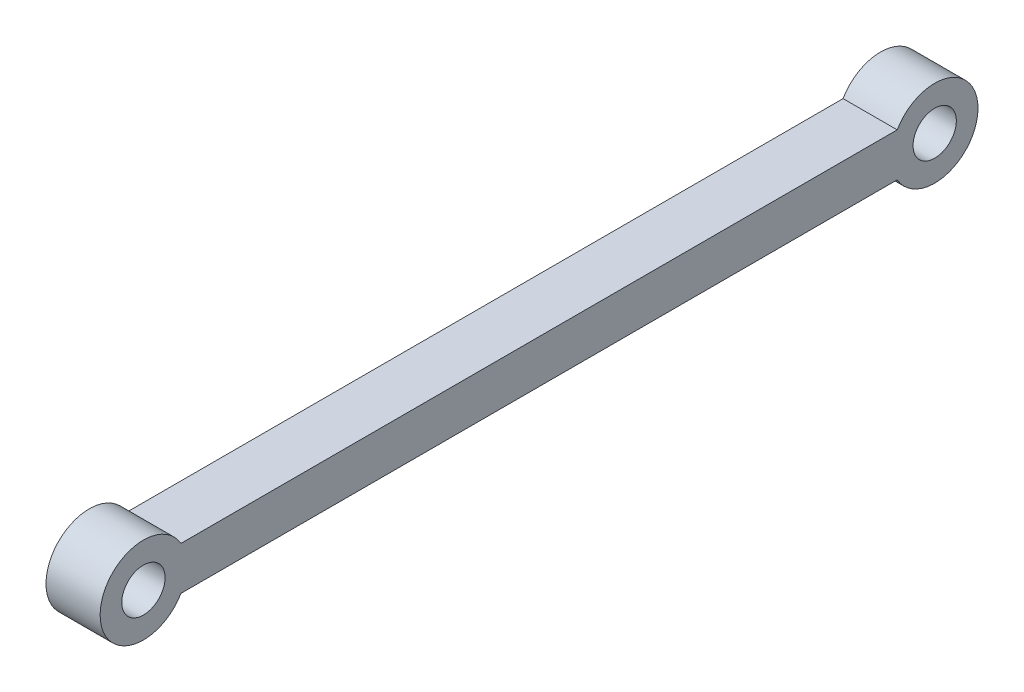
ISO-10303-21;
HEADER;
FILE_DESCRIPTION(('STEP AP214'),'2;1');
FILE_NAME('part.step','',(''),(''),'','','');
FILE_SCHEMA(('AUTOMOTIVE_DESIGN { 1 0 10303 214 1 1 1 1 }'));
ENDSEC;
DATA;
#1=APPLICATION_CONTEXT('core data for automotive mechanical design processes');
#2=APPLICATION_PROTOCOL_DEFINITION('international standard','automotive_design',2000,#1);
#3=PRODUCT_CONTEXT('',#1,'mechanical');
#4=PRODUCT('Part','Part','',(#3));
#5=PRODUCT_RELATED_PRODUCT_CATEGORY('part','',(#4));
#6=PRODUCT_DEFINITION_FORMATION('','',#4);
#7=PRODUCT_DEFINITION_CONTEXT('part definition',#1,'design');
#8=PRODUCT_DEFINITION('design','',#6,#7);
#9=PRODUCT_DEFINITION_SHAPE('','',#8);
#10=(LENGTH_UNIT() NAMED_UNIT(*) SI_UNIT(.MILLI.,.METRE.));
#11=(NAMED_UNIT(*) PLANE_ANGLE_UNIT() SI_UNIT($,.RADIAN.));
#12=(NAMED_UNIT(*) SI_UNIT($,.STERADIAN.) SOLID_ANGLE_UNIT());
#13=UNCERTAINTY_MEASURE_WITH_UNIT(LENGTH_MEASURE(1.E-05),#10,'distance_accuracy_value','');
#14=(GEOMETRIC_REPRESENTATION_CONTEXT(3) GLOBAL_UNCERTAINTY_ASSIGNED_CONTEXT((#13)) GLOBAL_UNIT_ASSIGNED_CONTEXT((#10,
#11,#12)) REPRESENTATION_CONTEXT('',''));
#15=CARTESIAN_POINT('',(0.,0.,0.));
#16=DIRECTION('',(0.,0.,1.));
#17=DIRECTION('',(1.,0.,0.));
#18=AXIS2_PLACEMENT_3D('',#15,#16,#17);
#19=CARTESIAN_POINT('',(1.25,0.,-18.27305));
#20=DIRECTION('',(1.,0.,0.));
#21=DIRECTION('',(0.,0.,-1.));
#22=AXIS2_PLACEMENT_3D('',#19,#20,#21);
#23=PLANE('',#22);
#24=CARTESIAN_POINT('',(1.25,0.,18.27305));
#25=DIRECTION('',(1.,0.,0.));
#26=DIRECTION('',(0.,0.,-1.));
#27=AXIS2_PLACEMENT_3D('',#24,#25,#26);
#28=CIRCLE('',#27,0.999999999999998);
#29=CARTESIAN_POINT('',(1.25,0.,17.27305));
#30=VERTEX_POINT('',#29);
#31=EDGE_CURVE('E118',#30,#30,#28,.T.);
#32=ORIENTED_EDGE('',*,*,#31,.F.);
#33=EDGE_LOOP('',(#32));
#34=FACE_BOUND('',#33,.T.);
#35=CARTESIAN_POINT('',(1.25,0.,-18.27305));
#36=DIRECTION('',(1.,0.,0.));
#37=DIRECTION('',(0.,0.,-1.));
#38=AXIS2_PLACEMENT_3D('',#35,#36,#37);
#39=CIRCLE('',#38,2.00000000000001);
#40=CARTESIAN_POINT('',(1.25,-1.,-16.5409991924311));
#41=VERTEX_POINT('',#40);
#42=CARTESIAN_POINT('',(1.25,1.,-16.5409991924311));
#43=VERTEX_POINT('',#42);
#44=EDGE_CURVE('E98',#41,#43,#39,.T.);
#45=ORIENTED_EDGE('',*,*,#44,.T.);
#46=DIRECTION('',(0.,0.,1.));
#47=VECTOR('',#46,1.);
#48=CARTESIAN_POINT('',(1.25,1.,16.5409991924311));
#49=LINE('',#48,#47);
#50=CARTESIAN_POINT('',(1.25,1.,16.5409991924311));
#51=VERTEX_POINT('',#50);
#52=EDGE_CURVE('E93',#43,#51,#49,.T.);
#53=ORIENTED_EDGE('',*,*,#52,.T.);
#54=CARTESIAN_POINT('',(1.25,0.,18.27305));
#55=DIRECTION('',(1.,0.,0.));
#56=DIRECTION('',(0.,0.,-1.));
#57=AXIS2_PLACEMENT_3D('',#54,#55,#56);
#58=CIRCLE('',#57,2.);
#59=CARTESIAN_POINT('',(1.25,-1.,16.5409991924311));
#60=VERTEX_POINT('',#59);
#61=EDGE_CURVE('E96',#51,#60,#58,.T.);
#62=ORIENTED_EDGE('',*,*,#61,.T.);
#63=DIRECTION('',(0.,0.,-1.));
#64=VECTOR('',#63,1.);
#65=CARTESIAN_POINT('',(1.25,-1.,16.5409991924311));
#66=LINE('',#65,#64);
#67=EDGE_CURVE('E63',#60,#41,#66,.T.);
#68=ORIENTED_EDGE('',*,*,#67,.T.);
#69=EDGE_LOOP('',(#45,#53,#62,#68));
#70=FACE_BOUND('',#69,.T.);
#71=CARTESIAN_POINT('',(1.25,0.,-18.27305));
#72=DIRECTION('',(1.,0.,0.));
#73=DIRECTION('',(0.,0.,-1.));
#74=AXIS2_PLACEMENT_3D('',#71,#72,#73);
#75=CIRCLE('',#74,0.999999999999998);
#76=CARTESIAN_POINT('',(1.25,0.,-19.27305));
#77=VERTEX_POINT('',#76);
#78=EDGE_CURVE('E140',#77,#77,#75,.T.);
#79=ORIENTED_EDGE('',*,*,#78,.F.);
#80=EDGE_LOOP('',(#79));
#81=FACE_BOUND('',#80,.T.);
#82=ADVANCED_FACE('F45',(#34,#70,#81),#23,.T.);
#83=CARTESIAN_POINT('',(-1.25,0.,-18.27305));
#84=DIRECTION('',(1.,0.,0.));
#85=DIRECTION('',(0.,0.,-1.));
#86=AXIS2_PLACEMENT_3D('',#83,#84,#85);
#87=PLANE('',#86);
#88=CARTESIAN_POINT('',(-1.25,0.,-18.27305));
#89=DIRECTION('',(1.,0.,0.));
#90=DIRECTION('',(0.,0.,-1.));
#91=AXIS2_PLACEMENT_3D('',#88,#89,#90);
#92=CIRCLE('',#91,2.00000000000001);
#93=CARTESIAN_POINT('',(-1.25,-1.,-16.5409991924311));
#94=VERTEX_POINT('',#93);
#95=CARTESIAN_POINT('',(-1.25,1.,-16.5409991924311));
#96=VERTEX_POINT('',#95);
#97=EDGE_CURVE('E114',#94,#96,#92,.T.);
#98=ORIENTED_EDGE('',*,*,#97,.F.);
#99=DIRECTION('',(0.,0.,-1.));
#100=VECTOR('',#99,1.);
#101=CARTESIAN_POINT('',(-1.25,-1.,16.5409991924311));
#102=LINE('',#101,#100);
#103=CARTESIAN_POINT('',(-1.25,-1.,16.5409991924311));
#104=VERTEX_POINT('',#103);
#105=EDGE_CURVE('E86',#104,#94,#102,.T.);
#106=ORIENTED_EDGE('',*,*,#105,.F.);
#107=CARTESIAN_POINT('',(-1.25,0.,18.27305));
#108=DIRECTION('',(1.,0.,0.));
#109=DIRECTION('',(0.,0.,-1.));
#110=AXIS2_PLACEMENT_3D('',#107,#108,#109);
#111=CIRCLE('',#110,2.);
#112=CARTESIAN_POINT('',(-1.25,1.,16.5409991924311));
#113=VERTEX_POINT('',#112);
#114=EDGE_CURVE('E80',#113,#104,#111,.T.);
#115=ORIENTED_EDGE('',*,*,#114,.F.);
#116=DIRECTION('',(0.,0.,1.));
#117=VECTOR('',#116,1.);
#118=CARTESIAN_POINT('',(-1.25,1.,16.5409991924311));
#119=LINE('',#118,#117);
#120=EDGE_CURVE('E103',#96,#113,#119,.T.);
#121=ORIENTED_EDGE('',*,*,#120,.F.);
#122=EDGE_LOOP('',(#98,#106,#115,#121));
#123=FACE_BOUND('',#122,.T.);
#124=CARTESIAN_POINT('',(-1.25,0.,18.27305));
#125=DIRECTION('',(1.,0.,0.));
#126=DIRECTION('',(0.,0.,-1.));
#127=AXIS2_PLACEMENT_3D('',#124,#125,#126);
#128=CIRCLE('',#127,0.999999999999998);
#129=CARTESIAN_POINT('',(-1.25,0.,17.27305));
#130=VERTEX_POINT('',#129);
#131=EDGE_CURVE('E136',#130,#130,#128,.T.);
#132=ORIENTED_EDGE('',*,*,#131,.T.);
#133=EDGE_LOOP('',(#132));
#134=FACE_BOUND('',#133,.T.);
#135=CARTESIAN_POINT('',(-1.25,0.,-18.27305));
#136=DIRECTION('',(1.,0.,0.));
#137=DIRECTION('',(0.,0.,-1.));
#138=AXIS2_PLACEMENT_3D('',#135,#136,#137);
#139=CIRCLE('',#138,0.999999999999998);
#140=CARTESIAN_POINT('',(-1.25,0.,-19.27305));
#141=VERTEX_POINT('',#140);
#142=EDGE_CURVE('E144',#141,#141,#139,.T.);
#143=ORIENTED_EDGE('',*,*,#142,.T.);
#144=EDGE_LOOP('',(#143));
#145=FACE_BOUND('',#144,.T.);
#146=ADVANCED_FACE('F131',(#123,#134,#145),#87,.F.);
#147=CARTESIAN_POINT('',(1.25,0.,-18.27305));
#148=DIRECTION('',(-1.,0.,0.));
#149=DIRECTION('',(0.,0.,1.));
#150=AXIS2_PLACEMENT_3D('',#147,#148,#149);
#151=CYLINDRICAL_SURFACE('',#150,2.00000000000001);
#152=ORIENTED_EDGE('',*,*,#97,.T.);
#153=DIRECTION('',(-1.,0.,0.));
#154=VECTOR('',#153,1.);
#155=CARTESIAN_POINT('',(1.25,1.,-16.5409991924311));
#156=LINE('',#155,#154);
#157=EDGE_CURVE('E11',#43,#96,#156,.T.);
#158=ORIENTED_EDGE('',*,*,#157,.F.);
#159=ORIENTED_EDGE('',*,*,#44,.F.);
#160=DIRECTION('',(-1.,0.,0.));
#161=VECTOR('',#160,1.);
#162=CARTESIAN_POINT('',(1.25,-1.,-16.5409991924311));
#163=LINE('',#162,#161);
#164=EDGE_CURVE('E110',#41,#94,#163,.T.);
#165=ORIENTED_EDGE('',*,*,#164,.T.);
#166=EDGE_LOOP('',(#152,#158,#159,#165));
#167=FACE_BOUND('',#166,.T.);
#168=ADVANCED_FACE('F47',(#167),#151,.T.);
#169=CARTESIAN_POINT('',(1.25,1.,16.5409991924311));
#170=DIRECTION('',(0.,-1.,0.));
#171=DIRECTION('',(0.,0.,-1.));
#172=AXIS2_PLACEMENT_3D('',#169,#170,#171);
#173=PLANE('',#172);
#174=ORIENTED_EDGE('',*,*,#120,.T.);
#175=DIRECTION('',(-1.,0.,0.));
#176=VECTOR('',#175,1.);
#177=CARTESIAN_POINT('',(1.25,1.,16.5409991924311));
#178=LINE('',#177,#176);
#179=EDGE_CURVE('E55',#51,#113,#178,.T.);
#180=ORIENTED_EDGE('',*,*,#179,.F.);
#181=ORIENTED_EDGE('',*,*,#52,.F.);
#182=ORIENTED_EDGE('',*,*,#157,.T.);
#183=EDGE_LOOP('',(#174,#180,#181,#182));
#184=FACE_BOUND('',#183,.T.);
#185=ADVANCED_FACE('F102',(#184),#173,.F.);
#186=CARTESIAN_POINT('',(1.25,0.,18.27305));
#187=DIRECTION('',(-1.,0.,0.));
#188=DIRECTION('',(0.,0.,1.));
#189=AXIS2_PLACEMENT_3D('',#186,#187,#188);
#190=CYLINDRICAL_SURFACE('',#189,2.);
#191=ORIENTED_EDGE('',*,*,#114,.T.);
#192=DIRECTION('',(-1.,0.,0.));
#193=VECTOR('',#192,1.);
#194=CARTESIAN_POINT('',(1.25,-1.,16.5409991924311));
#195=LINE('',#194,#193);
#196=EDGE_CURVE('E105',#60,#104,#195,.T.);
#197=ORIENTED_EDGE('',*,*,#196,.F.);
#198=ORIENTED_EDGE('',*,*,#61,.F.);
#199=ORIENTED_EDGE('',*,*,#179,.T.);
#200=EDGE_LOOP('',(#191,#197,#198,#199));
#201=FACE_BOUND('',#200,.T.);
#202=ADVANCED_FACE('F106',(#201),#190,.T.);
#203=CARTESIAN_POINT('',(1.25,-1.,16.5409991924311));
#204=DIRECTION('',(0.,1.,0.));
#205=DIRECTION('',(0.,0.,1.));
#206=AXIS2_PLACEMENT_3D('',#203,#204,#205);
#207=PLANE('',#206);
#208=ORIENTED_EDGE('',*,*,#105,.T.);
#209=ORIENTED_EDGE('',*,*,#164,.F.);
#210=ORIENTED_EDGE('',*,*,#67,.F.);
#211=ORIENTED_EDGE('',*,*,#196,.T.);
#212=EDGE_LOOP('',(#208,#209,#210,#211));
#213=FACE_BOUND('',#212,.T.);
#214=ADVANCED_FACE('F128',(#213),#207,.F.);
#215=CARTESIAN_POINT('',(1.25,0.,18.27305));
#216=DIRECTION('',(-1.,0.,0.));
#217=DIRECTION('',(0.,0.,1.));
#218=AXIS2_PLACEMENT_3D('',#215,#216,#217);
#219=CYLINDRICAL_SURFACE('',#218,0.999999999999998);
#220=ORIENTED_EDGE('',*,*,#31,.T.);
#221=EDGE_LOOP('',(#220));
#222=FACE_BOUND('',#221,.T.);
#223=ORIENTED_EDGE('',*,*,#131,.F.);
#224=EDGE_LOOP('',(#223));
#225=FACE_BOUND('',#224,.T.);
#226=ADVANCED_FACE('F163',(#222,#225),#219,.F.);
#227=CARTESIAN_POINT('',(1.25,0.,-18.27305));
#228=DIRECTION('',(-1.,0.,0.));
#229=DIRECTION('',(0.,0.,1.));
#230=AXIS2_PLACEMENT_3D('',#227,#228,#229);
#231=CYLINDRICAL_SURFACE('',#230,0.999999999999998);
#232=ORIENTED_EDGE('',*,*,#78,.T.);
#233=EDGE_LOOP('',(#232));
#234=FACE_BOUND('',#233,.T.);
#235=ORIENTED_EDGE('',*,*,#142,.F.);
#236=EDGE_LOOP('',(#235));
#237=FACE_BOUND('',#236,.T.);
#238=ADVANCED_FACE('F152',(#234,#237),#231,.F.);
#239=CLOSED_SHELL('',(#82,#146,#168,#185,#202,#214,#226,#238));
#240=MANIFOLD_SOLID_BREP('B2',#239);
#241=ADVANCED_BREP_SHAPE_REPRESENTATION('',(#18,#240),#14);
#242=SHAPE_DEFINITION_REPRESENTATION(#9,#241);
ENDSEC;
END-ISO-10303-21;
